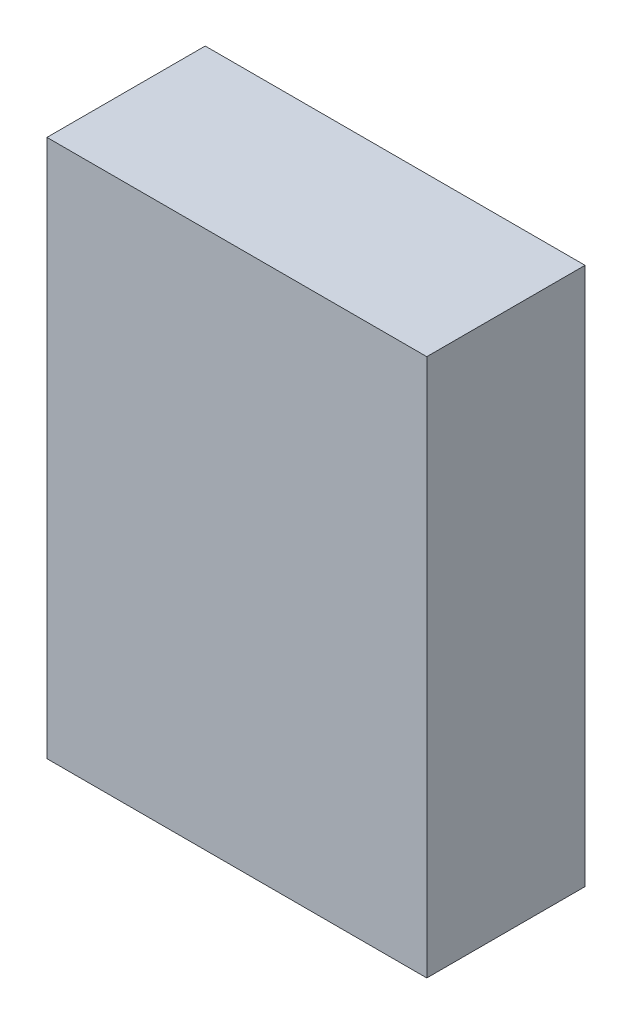
ISO-10303-21;
HEADER;
FILE_DESCRIPTION(('STEP AP214'),'2;1');
FILE_NAME('part.step','',(''),(''),'','','');
FILE_SCHEMA(('AUTOMOTIVE_DESIGN { 1 0 10303 214 1 1 1 1 }'));
ENDSEC;
DATA;
#1=APPLICATION_CONTEXT('core data for automotive mechanical design processes');
#2=APPLICATION_PROTOCOL_DEFINITION('international standard','automotive_design',2000,#1);
#3=PRODUCT_CONTEXT('',#1,'mechanical');
#4=PRODUCT('Part','Part','',(#3));
#5=PRODUCT_RELATED_PRODUCT_CATEGORY('part','',(#4));
#6=PRODUCT_DEFINITION_FORMATION('','',#4);
#7=PRODUCT_DEFINITION_CONTEXT('part definition',#1,'design');
#8=PRODUCT_DEFINITION('design','',#6,#7);
#9=PRODUCT_DEFINITION_SHAPE('','',#8);
#10=(LENGTH_UNIT() NAMED_UNIT(*) SI_UNIT(.MILLI.,.METRE.));
#11=(NAMED_UNIT(*) PLANE_ANGLE_UNIT() SI_UNIT($,.RADIAN.));
#12=(NAMED_UNIT(*) SI_UNIT($,.STERADIAN.) SOLID_ANGLE_UNIT());
#13=UNCERTAINTY_MEASURE_WITH_UNIT(LENGTH_MEASURE(1.E-05),#10,'distance_accuracy_value','');
#14=(GEOMETRIC_REPRESENTATION_CONTEXT(3) GLOBAL_UNCERTAINTY_ASSIGNED_CONTEXT((#13)) GLOBAL_UNIT_ASSIGNED_CONTEXT((#10,
#11,#12)) REPRESENTATION_CONTEXT('',''));
#15=CARTESIAN_POINT('',(0.,0.,0.));
#16=DIRECTION('',(0.,0.,1.));
#17=DIRECTION('',(1.,0.,0.));
#18=AXIS2_PLACEMENT_3D('',#15,#16,#17);
#19=CARTESIAN_POINT('',(-1.37,2.58,0.));
#20=DIRECTION('',(1.,0.,0.));
#21=DIRECTION('',(0.,0.,1.));
#22=AXIS2_PLACEMENT_3D('',#19,#20,#21);
#23=PLANE('',#22);
#24=DIRECTION('',(0.,1.,0.));
#25=VECTOR('',#24,1.);
#26=CARTESIAN_POINT('',(-1.37,2.58,0.1));
#27=LINE('',#26,#25);
#28=CARTESIAN_POINT('',(-1.37,2.58,0.1));
#29=VERTEX_POINT('',#28);
#30=CARTESIAN_POINT('',(-1.37,2.92,0.1));
#31=VERTEX_POINT('',#30);
#32=EDGE_CURVE('E11',#29,#31,#27,.T.);
#33=ORIENTED_EDGE('',*,*,#32,.T.);
#34=DIRECTION('',(0.,0.,1.));
#35=VECTOR('',#34,1.);
#36=CARTESIAN_POINT('',(-1.37,2.92,0.));
#37=LINE('',#36,#35);
#38=CARTESIAN_POINT('',(-1.37,2.92,0.));
#39=VERTEX_POINT('',#38);
#40=EDGE_CURVE('E24',#39,#31,#37,.T.);
#41=ORIENTED_EDGE('',*,*,#40,.F.);
#42=DIRECTION('',(0.,1.,0.));
#43=VECTOR('',#42,1.);
#44=CARTESIAN_POINT('',(-1.37,2.58,0.));
#45=LINE('',#44,#43);
#46=CARTESIAN_POINT('',(-1.37,2.58,0.));
#47=VERTEX_POINT('',#46);
#48=EDGE_CURVE('E86',#47,#39,#45,.T.);
#49=ORIENTED_EDGE('',*,*,#48,.F.);
#50=DIRECTION('',(0.,0.,1.));
#51=VECTOR('',#50,1.);
#52=CARTESIAN_POINT('',(-1.37,2.58,0.));
#53=LINE('',#52,#51);
#54=EDGE_CURVE('E36',#47,#29,#53,.T.);
#55=ORIENTED_EDGE('',*,*,#54,.T.);
#56=EDGE_LOOP('',(#33,#41,#49,#55));
#57=FACE_BOUND('',#56,.T.);
#58=ADVANCED_FACE('F17',(#57),#23,.F.);
#59=CARTESIAN_POINT('',(-1.13,2.58,0.));
#60=DIRECTION('',(1.,0.,0.));
#61=DIRECTION('',(0.,0.,1.));
#62=AXIS2_PLACEMENT_3D('',#59,#60,#61);
#63=PLANE('',#62);
#64=DIRECTION('',(0.,0.,1.));
#65=VECTOR('',#64,1.);
#66=CARTESIAN_POINT('',(-1.13,2.58,0.));
#67=LINE('',#66,#65);
#68=CARTESIAN_POINT('',(-1.13,2.58,0.));
#69=VERTEX_POINT('',#68);
#70=CARTESIAN_POINT('',(-1.13,2.58,0.1));
#71=VERTEX_POINT('',#70);
#72=EDGE_CURVE('E83',#69,#71,#67,.T.);
#73=ORIENTED_EDGE('',*,*,#72,.F.);
#74=DIRECTION('',(0.,1.,0.));
#75=VECTOR('',#74,1.);
#76=CARTESIAN_POINT('',(-1.13,2.58,0.));
#77=LINE('',#76,#75);
#78=CARTESIAN_POINT('',(-1.13,2.92,0.));
#79=VERTEX_POINT('',#78);
#80=EDGE_CURVE('E63',#69,#79,#77,.T.);
#81=ORIENTED_EDGE('',*,*,#80,.T.);
#82=DIRECTION('',(0.,0.,1.));
#83=VECTOR('',#82,1.);
#84=CARTESIAN_POINT('',(-1.13,2.92,0.));
#85=LINE('',#84,#83);
#86=CARTESIAN_POINT('',(-1.13,2.92,0.1));
#87=VERTEX_POINT('',#86);
#88=EDGE_CURVE('E57',#79,#87,#85,.T.);
#89=ORIENTED_EDGE('',*,*,#88,.T.);
#90=DIRECTION('',(0.,1.,0.));
#91=VECTOR('',#90,1.);
#92=CARTESIAN_POINT('',(-1.13,2.58,0.1));
#93=LINE('',#92,#91);
#94=EDGE_CURVE('E60',#71,#87,#93,.T.);
#95=ORIENTED_EDGE('',*,*,#94,.F.);
#96=EDGE_LOOP('',(#73,#81,#89,#95));
#97=FACE_BOUND('',#96,.T.);
#98=ADVANCED_FACE('F59',(#97),#63,.T.);
#99=CARTESIAN_POINT('',(-1.37,2.58,0.));
#100=DIRECTION('',(0.,1.,0.));
#101=DIRECTION('',(0.,0.,1.));
#102=AXIS2_PLACEMENT_3D('',#99,#100,#101);
#103=PLANE('',#102);
#104=ORIENTED_EDGE('',*,*,#72,.T.);
#105=DIRECTION('',(1.,0.,0.));
#106=VECTOR('',#105,1.);
#107=CARTESIAN_POINT('',(-1.37,2.58,0.1));
#108=LINE('',#107,#106);
#109=EDGE_CURVE('E71',#29,#71,#108,.T.);
#110=ORIENTED_EDGE('',*,*,#109,.F.);
#111=ORIENTED_EDGE('',*,*,#54,.F.);
#112=DIRECTION('',(1.,0.,0.));
#113=VECTOR('',#112,1.);
#114=CARTESIAN_POINT('',(-1.37,2.58,0.));
#115=LINE('',#114,#113);
#116=EDGE_CURVE('E76',#47,#69,#115,.T.);
#117=ORIENTED_EDGE('',*,*,#116,.T.);
#118=EDGE_LOOP('',(#104,#110,#111,#117));
#119=FACE_BOUND('',#118,.T.);
#120=ADVANCED_FACE('F91',(#119),#103,.F.);
#121=CARTESIAN_POINT('',(-1.37,2.92,0.));
#122=DIRECTION('',(0.,1.,0.));
#123=DIRECTION('',(0.,0.,1.));
#124=AXIS2_PLACEMENT_3D('',#121,#122,#123);
#125=PLANE('',#124);
#126=DIRECTION('',(1.,0.,0.));
#127=VECTOR('',#126,1.);
#128=CARTESIAN_POINT('',(-1.37,2.92,0.));
#129=LINE('',#128,#127);
#130=EDGE_CURVE('E74',#39,#79,#129,.T.);
#131=ORIENTED_EDGE('',*,*,#130,.F.);
#132=ORIENTED_EDGE('',*,*,#40,.T.);
#133=DIRECTION('',(1.,0.,0.));
#134=VECTOR('',#133,1.);
#135=CARTESIAN_POINT('',(-1.37,2.92,0.1));
#136=LINE('',#135,#134);
#137=EDGE_CURVE('E69',#31,#87,#136,.T.);
#138=ORIENTED_EDGE('',*,*,#137,.T.);
#139=ORIENTED_EDGE('',*,*,#88,.F.);
#140=EDGE_LOOP('',(#131,#132,#138,#139));
#141=FACE_BOUND('',#140,.T.);
#142=ADVANCED_FACE('F73',(#141),#125,.T.);
#143=CARTESIAN_POINT('',(-1.37,2.58,0.));
#144=DIRECTION('',(0.,0.,1.));
#145=DIRECTION('',(1.,0.,0.));
#146=AXIS2_PLACEMENT_3D('',#143,#144,#145);
#147=PLANE('',#146);
#148=ORIENTED_EDGE('',*,*,#130,.T.);
#149=ORIENTED_EDGE('',*,*,#80,.F.);
#150=ORIENTED_EDGE('',*,*,#116,.F.);
#151=ORIENTED_EDGE('',*,*,#48,.T.);
#152=EDGE_LOOP('',(#148,#149,#150,#151));
#153=FACE_BOUND('',#152,.T.);
#154=ADVANCED_FACE('F89',(#153),#147,.F.);
#155=CARTESIAN_POINT('',(-1.37,2.58,0.1));
#156=DIRECTION('',(0.,0.,1.));
#157=DIRECTION('',(1.,0.,0.));
#158=AXIS2_PLACEMENT_3D('',#155,#156,#157);
#159=PLANE('',#158);
#160=ORIENTED_EDGE('',*,*,#32,.F.);
#161=ORIENTED_EDGE('',*,*,#109,.T.);
#162=ORIENTED_EDGE('',*,*,#94,.T.);
#163=ORIENTED_EDGE('',*,*,#137,.F.);
#164=EDGE_LOOP('',(#160,#161,#162,#163));
#165=FACE_BOUND('',#164,.T.);
#166=ADVANCED_FACE('F68',(#165),#159,.T.);
#167=CLOSED_SHELL('',(#58,#98,#120,#142,#154,#166));
#168=MANIFOLD_SOLID_BREP('B1',#167);
#169=ADVANCED_BREP_SHAPE_REPRESENTATION('',(#18,#168),#14);
#170=SHAPE_DEFINITION_REPRESENTATION(#9,#169);
ENDSEC;
END-ISO-10303-21;
